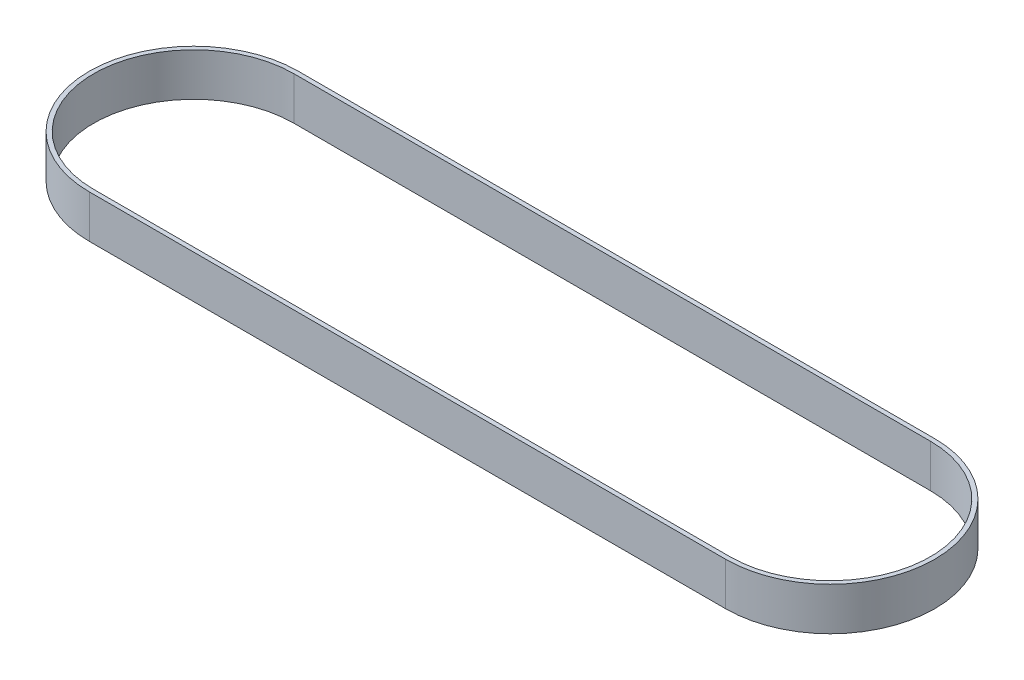
ISO-10303-21;
HEADER;
FILE_DESCRIPTION(('STEP AP214'),'2;1');
FILE_NAME('part.step','',(''),(''),'','','');
FILE_SCHEMA(('AUTOMOTIVE_DESIGN { 1 0 10303 214 1 1 1 1 }'));
ENDSEC;
DATA;
#1=APPLICATION_CONTEXT('core data for automotive mechanical design processes');
#2=APPLICATION_PROTOCOL_DEFINITION('international standard','automotive_design',2000,#1);
#3=PRODUCT_CONTEXT('',#1,'mechanical');
#4=PRODUCT('Part','Part','',(#3));
#5=PRODUCT_RELATED_PRODUCT_CATEGORY('part','',(#4));
#6=PRODUCT_DEFINITION_FORMATION('','',#4);
#7=PRODUCT_DEFINITION_CONTEXT('part definition',#1,'design');
#8=PRODUCT_DEFINITION('design','',#6,#7);
#9=PRODUCT_DEFINITION_SHAPE('','',#8);
#10=(LENGTH_UNIT() NAMED_UNIT(*) SI_UNIT(.MILLI.,.METRE.));
#11=(NAMED_UNIT(*) PLANE_ANGLE_UNIT() SI_UNIT($,.RADIAN.));
#12=(NAMED_UNIT(*) SI_UNIT($,.STERADIAN.) SOLID_ANGLE_UNIT());
#13=UNCERTAINTY_MEASURE_WITH_UNIT(LENGTH_MEASURE(1.E-05),#10,'distance_accuracy_value','');
#14=(GEOMETRIC_REPRESENTATION_CONTEXT(3) GLOBAL_UNCERTAINTY_ASSIGNED_CONTEXT((#13)) GLOBAL_UNIT_ASSIGNED_CONTEXT((#10,
#11,#12)) REPRESENTATION_CONTEXT('',''));
#15=CARTESIAN_POINT('',(0.,0.,0.));
#16=DIRECTION('',(0.,0.,1.));
#17=DIRECTION('',(1.,0.,0.));
#18=AXIS2_PLACEMENT_3D('',#15,#16,#17);
#19=CARTESIAN_POINT('',(0.,15.,-36.5379));
#20=DIRECTION('',(0.,0.,1.));
#21=DIRECTION('',(1.,0.,0.));
#22=AXIS2_PLACEMENT_3D('',#19,#20,#21);
#23=PLANE('',#22);
#24=DIRECTION('',(0.,-1.,0.));
#25=VECTOR('',#24,1.);
#26=CARTESIAN_POINT('',(0.,15.,-36.5379));
#27=LINE('',#26,#25);
#28=CARTESIAN_POINT('',(0.,15.,-36.5379000004));
#29=VERTEX_POINT('',#28);
#30=CARTESIAN_POINT('',(0.,0.,-36.5379000004));
#31=VERTEX_POINT('',#30);
#32=EDGE_CURVE('E66',#29,#31,#27,.T.);
#33=ORIENTED_EDGE('',*,*,#32,.F.);
#34=DIRECTION('',(1.,0.,0.));
#35=VECTOR('',#34,1.);
#36=CARTESIAN_POINT('',(0.,15.,-36.5379000008));
#37=LINE('',#36,#35);
#38=CARTESIAN_POINT('',(222.5548,15.,-36.5379000004));
#39=VERTEX_POINT('',#38);
#40=EDGE_CURVE('E68',#39,#29,#37,.F.);
#41=ORIENTED_EDGE('',*,*,#40,.F.);
#42=DIRECTION('',(0.,-1.,0.));
#43=VECTOR('',#42,1.);
#44=CARTESIAN_POINT('',(222.5548,15.,-36.5379));
#45=LINE('',#44,#43);
#46=CARTESIAN_POINT('',(222.5548,0.,-36.5379000004));
#47=VERTEX_POINT('',#46);
#48=EDGE_CURVE('E116',#47,#39,#45,.F.);
#49=ORIENTED_EDGE('',*,*,#48,.F.);
#50=DIRECTION('',(1.,0.,0.));
#51=VECTOR('',#50,1.);
#52=CARTESIAN_POINT('',(0.,0.,-36.5379000008));
#53=LINE('',#52,#51);
#54=EDGE_CURVE('E70',#47,#31,#53,.F.);
#55=ORIENTED_EDGE('',*,*,#54,.T.);
#56=EDGE_LOOP('',(#33,#41,#49,#55));
#57=FACE_BOUND('',#56,.T.);
#58=ADVANCED_FACE('F17',(#57),#23,.F.);
#59=CARTESIAN_POINT('',(0.,15.,-35.0139));
#60=DIRECTION('',(0.,0.,1.));
#61=DIRECTION('',(1.,0.,0.));
#62=AXIS2_PLACEMENT_3D('',#59,#60,#61);
#63=PLANE('',#62);
#64=DIRECTION('',(1.,0.,0.));
#65=VECTOR('',#64,1.);
#66=CARTESIAN_POINT('',(0.,15.,-35.0139000006));
#67=LINE('',#66,#65);
#68=CARTESIAN_POINT('',(0.,15.,-35.0139000003));
#69=VERTEX_POINT('',#68);
#70=CARTESIAN_POINT('',(222.5548,15.,-35.0139000003));
#71=VERTEX_POINT('',#70);
#72=EDGE_CURVE('E100',#69,#71,#67,.T.);
#73=ORIENTED_EDGE('',*,*,#72,.F.);
#74=DIRECTION('',(0.,-1.,0.));
#75=VECTOR('',#74,1.);
#76=CARTESIAN_POINT('',(0.,15.,-35.0139));
#77=LINE('',#76,#75);
#78=CARTESIAN_POINT('',(0.,0.,-35.0139000003));
#79=VERTEX_POINT('',#78);
#80=EDGE_CURVE('E75',#69,#79,#77,.T.);
#81=ORIENTED_EDGE('',*,*,#80,.T.);
#82=DIRECTION('',(1.,0.,0.));
#83=VECTOR('',#82,1.);
#84=CARTESIAN_POINT('',(0.,0.,-35.0139000006));
#85=LINE('',#84,#83);
#86=CARTESIAN_POINT('',(222.5548,0.,-35.0139000003));
#87=VERTEX_POINT('',#86);
#88=EDGE_CURVE('E121',#79,#87,#85,.T.);
#89=ORIENTED_EDGE('',*,*,#88,.T.);
#90=DIRECTION('',(0.,-1.,0.));
#91=VECTOR('',#90,1.);
#92=CARTESIAN_POINT('',(222.5548,15.,-35.0139));
#93=LINE('',#92,#91);
#94=EDGE_CURVE('E113',#87,#71,#93,.F.);
#95=ORIENTED_EDGE('',*,*,#94,.T.);
#96=EDGE_LOOP('',(#73,#81,#89,#95));
#97=FACE_BOUND('',#96,.T.);
#98=ADVANCED_FACE('F134',(#97),#63,.T.);
#99=CARTESIAN_POINT('',(222.5548,15.,0.));
#100=DIRECTION('',(0.,-1.,0.));
#101=DIRECTION('',(0.,0.,-1.));
#102=AXIS2_PLACEMENT_3D('',#99,#100,#101);
#103=CYLINDRICAL_SURFACE('',#102,35.0139);
#104=DIRECTION('',(0.,1.,0.));
#105=VECTOR('',#104,1.);
#106=CARTESIAN_POINT('',(222.5548,15.,35.0139));
#107=LINE('',#106,#105);
#108=CARTESIAN_POINT('',(222.5548,15.,35.0139000003));
#109=VERTEX_POINT('',#108);
#110=CARTESIAN_POINT('',(222.5548,0.,35.0139000003));
#111=VERTEX_POINT('',#110);
#112=EDGE_CURVE('E110',#109,#111,#107,.F.);
#113=ORIENTED_EDGE('',*,*,#112,.F.);
#114=CARTESIAN_POINT('',(222.5548,15.,0.));
#115=DIRECTION('',(0.,-1.,0.));
#116=DIRECTION('',(0.,0.,-1.));
#117=AXIS2_PLACEMENT_3D('',#114,#115,#116);
#118=CIRCLE('',#117,35.0139);
#119=EDGE_CURVE('E102',#71,#109,#118,.T.);
#120=ORIENTED_EDGE('',*,*,#119,.F.);
#121=ORIENTED_EDGE('',*,*,#94,.F.);
#122=CARTESIAN_POINT('',(222.5548,0.,0.));
#123=DIRECTION('',(0.,-1.,0.));
#124=DIRECTION('',(0.,0.,-1.));
#125=AXIS2_PLACEMENT_3D('',#122,#123,#124);
#126=CIRCLE('',#125,35.0139);
#127=EDGE_CURVE('E118',#87,#111,#126,.T.);
#128=ORIENTED_EDGE('',*,*,#127,.T.);
#129=EDGE_LOOP('',(#113,#120,#121,#128));
#130=FACE_BOUND('',#129,.T.);
#131=ADVANCED_FACE('F143',(#130),#103,.F.);
#132=CARTESIAN_POINT('',(0.,15.,35.0139));
#133=DIRECTION('',(0.,0.,-1.));
#134=DIRECTION('',(-1.,0.,0.));
#135=AXIS2_PLACEMENT_3D('',#132,#133,#134);
#136=PLANE('',#135);
#137=DIRECTION('',(1.,0.,0.));
#138=VECTOR('',#137,1.);
#139=CARTESIAN_POINT('',(0.,15.,35.0139000006));
#140=LINE('',#139,#138);
#141=CARTESIAN_POINT('',(0.,15.,35.0139000003));
#142=VERTEX_POINT('',#141);
#143=EDGE_CURVE('E83',#109,#142,#140,.F.);
#144=ORIENTED_EDGE('',*,*,#143,.F.);
#145=ORIENTED_EDGE('',*,*,#112,.T.);
#146=DIRECTION('',(1.,0.,0.));
#147=VECTOR('',#146,1.);
#148=CARTESIAN_POINT('',(0.,0.,35.0139000006));
#149=LINE('',#148,#147);
#150=CARTESIAN_POINT('',(0.,0.,35.0139000003));
#151=VERTEX_POINT('',#150);
#152=EDGE_CURVE('E96',#111,#151,#149,.F.);
#153=ORIENTED_EDGE('',*,*,#152,.T.);
#154=DIRECTION('',(0.,-1.,0.));
#155=VECTOR('',#154,1.);
#156=CARTESIAN_POINT('',(0.,15.,35.0139));
#157=LINE('',#156,#155);
#158=EDGE_CURVE('E107',#151,#142,#157,.F.);
#159=ORIENTED_EDGE('',*,*,#158,.T.);
#160=EDGE_LOOP('',(#144,#145,#153,#159));
#161=FACE_BOUND('',#160,.T.);
#162=ADVANCED_FACE('F145',(#161),#136,.T.);
#163=CARTESIAN_POINT('',(0.,15.,0.));
#164=DIRECTION('',(0.,-1.,0.));
#165=DIRECTION('',(0.,0.,-1.));
#166=AXIS2_PLACEMENT_3D('',#163,#164,#165);
#167=CYLINDRICAL_SURFACE('',#166,35.0139);
#168=ORIENTED_EDGE('',*,*,#80,.F.);
#169=CARTESIAN_POINT('',(0.,15.,0.));
#170=DIRECTION('',(0.,-1.,0.));
#171=DIRECTION('',(0.,0.,-1.));
#172=AXIS2_PLACEMENT_3D('',#169,#170,#171);
#173=CIRCLE('',#172,35.0139);
#174=EDGE_CURVE('E103',#142,#69,#173,.T.);
#175=ORIENTED_EDGE('',*,*,#174,.F.);
#176=ORIENTED_EDGE('',*,*,#158,.F.);
#177=CARTESIAN_POINT('',(0.,0.,0.));
#178=DIRECTION('',(0.,-1.,0.));
#179=DIRECTION('',(0.,0.,-1.));
#180=AXIS2_PLACEMENT_3D('',#177,#178,#179);
#181=CIRCLE('',#180,35.0139);
#182=EDGE_CURVE('E92',#151,#79,#181,.T.);
#183=ORIENTED_EDGE('',*,*,#182,.T.);
#184=EDGE_LOOP('',(#168,#175,#176,#183));
#185=FACE_BOUND('',#184,.T.);
#186=ADVANCED_FACE('F151',(#185),#167,.F.);
#187=CARTESIAN_POINT('',(0.,15.,0.));
#188=DIRECTION('',(0.,-1.,0.));
#189=DIRECTION('',(0.,0.,-1.));
#190=AXIS2_PLACEMENT_3D('',#187,#188,#189);
#191=CYLINDRICAL_SURFACE('',#190,36.5379);
#192=CARTESIAN_POINT('',(0.,15.,0.));
#193=DIRECTION('',(0.,-1.,0.));
#194=DIRECTION('',(0.,0.,-1.));
#195=AXIS2_PLACEMENT_3D('',#192,#193,#194);
#196=CIRCLE('',#195,36.5379);
#197=CARTESIAN_POINT('',(0.,15.,36.5379));
#198=VERTEX_POINT('',#197);
#199=EDGE_CURVE('E20',#29,#198,#196,.F.);
#200=ORIENTED_EDGE('',*,*,#199,.F.);
#201=ORIENTED_EDGE('',*,*,#32,.T.);
#202=CARTESIAN_POINT('',(0.,0.,0.));
#203=DIRECTION('',(0.,-1.,0.));
#204=DIRECTION('',(0.,0.,-1.));
#205=AXIS2_PLACEMENT_3D('',#202,#203,#204);
#206=CIRCLE('',#205,36.5379);
#207=CARTESIAN_POINT('',(0.,0.,36.5379));
#208=VERTEX_POINT('',#207);
#209=EDGE_CURVE('E89',#31,#208,#206,.F.);
#210=ORIENTED_EDGE('',*,*,#209,.T.);
#211=DIRECTION('',(0.,1.,0.));
#212=VECTOR('',#211,1.);
#213=CARTESIAN_POINT('',(0.,15.,36.5379));
#214=LINE('',#213,#212);
#215=EDGE_CURVE('E88',#208,#198,#214,.T.);
#216=ORIENTED_EDGE('',*,*,#215,.T.);
#217=EDGE_LOOP('',(#200,#201,#210,#216));
#218=FACE_BOUND('',#217,.T.);
#219=ADVANCED_FACE('F86',(#218),#191,.T.);
#220=CARTESIAN_POINT('',(0.,15.,0.));
#221=DIRECTION('',(0.,1.,0.));
#222=DIRECTION('',(0.,0.,1.));
#223=AXIS2_PLACEMENT_3D('',#220,#221,#222);
#224=PLANE('',#223);
#225=ORIENTED_EDGE('',*,*,#72,.T.);
#226=ORIENTED_EDGE('',*,*,#119,.T.);
#227=ORIENTED_EDGE('',*,*,#143,.T.);
#228=ORIENTED_EDGE('',*,*,#174,.T.);
#229=EDGE_LOOP('',(#225,#226,#227,#228));
#230=FACE_BOUND('',#229,.T.);
#231=CARTESIAN_POINT('',(222.5548,15.,0.));
#232=DIRECTION('',(0.,-1.,0.));
#233=DIRECTION('',(0.,0.,-1.));
#234=AXIS2_PLACEMENT_3D('',#231,#232,#233);
#235=CIRCLE('',#234,36.5379);
#236=CARTESIAN_POINT('',(222.5548,15.,36.5379));
#237=VERTEX_POINT('',#236);
#238=EDGE_CURVE('E82',#39,#237,#235,.T.);
#239=ORIENTED_EDGE('',*,*,#238,.F.);
#240=ORIENTED_EDGE('',*,*,#40,.T.);
#241=ORIENTED_EDGE('',*,*,#199,.T.);
#242=DIRECTION('',(-1.,0.,0.));
#243=VECTOR('',#242,1.);
#244=CARTESIAN_POINT('',(0.,15.,36.5379));
#245=LINE('',#244,#243);
#246=EDGE_CURVE('E91',#198,#237,#245,.F.);
#247=ORIENTED_EDGE('',*,*,#246,.T.);
#248=EDGE_LOOP('',(#239,#240,#241,#247));
#249=FACE_BOUND('',#248,.T.);
#250=ADVANCED_FACE('F79',(#230,#249),#224,.T.);
#251=CARTESIAN_POINT('',(222.5548,15.,0.));
#252=DIRECTION('',(0.,-1.,0.));
#253=DIRECTION('',(0.,0.,-1.));
#254=AXIS2_PLACEMENT_3D('',#251,#252,#253);
#255=CYLINDRICAL_SURFACE('',#254,36.5379);
#256=ORIENTED_EDGE('',*,*,#238,.T.);
#257=DIRECTION('',(0.,1.,0.));
#258=VECTOR('',#257,1.);
#259=CARTESIAN_POINT('',(222.5548,15.,36.5379));
#260=LINE('',#259,#258);
#261=CARTESIAN_POINT('',(222.5548,0.,36.5379));
#262=VERTEX_POINT('',#261);
#263=EDGE_CURVE('E26',#237,#262,#260,.F.);
#264=ORIENTED_EDGE('',*,*,#263,.T.);
#265=CARTESIAN_POINT('',(222.5548,0.,0.));
#266=DIRECTION('',(0.,-1.,0.));
#267=DIRECTION('',(0.,0.,-1.));
#268=AXIS2_PLACEMENT_3D('',#265,#266,#267);
#269=CIRCLE('',#268,36.5379);
#270=EDGE_CURVE('E34',#262,#47,#269,.F.);
#271=ORIENTED_EDGE('',*,*,#270,.T.);
#272=ORIENTED_EDGE('',*,*,#48,.T.);
#273=EDGE_LOOP('',(#256,#264,#271,#272));
#274=FACE_BOUND('',#273,.T.);
#275=ADVANCED_FACE('F162',(#274),#255,.T.);
#276=CARTESIAN_POINT('',(0.,0.,0.));
#277=DIRECTION('',(0.,1.,0.));
#278=DIRECTION('',(0.,0.,1.));
#279=AXIS2_PLACEMENT_3D('',#276,#277,#278);
#280=PLANE('',#279);
#281=ORIENTED_EDGE('',*,*,#152,.F.);
#282=ORIENTED_EDGE('',*,*,#127,.F.);
#283=ORIENTED_EDGE('',*,*,#88,.F.);
#284=ORIENTED_EDGE('',*,*,#182,.F.);
#285=EDGE_LOOP('',(#281,#282,#283,#284));
#286=FACE_BOUND('',#285,.T.);
#287=ORIENTED_EDGE('',*,*,#54,.F.);
#288=ORIENTED_EDGE('',*,*,#270,.F.);
#289=DIRECTION('',(-1.,0.,0.));
#290=VECTOR('',#289,1.);
#291=CARTESIAN_POINT('',(0.,0.,36.5379));
#292=LINE('',#291,#290);
#293=EDGE_CURVE('E11',#262,#208,#292,.T.);
#294=ORIENTED_EDGE('',*,*,#293,.T.);
#295=ORIENTED_EDGE('',*,*,#209,.F.);
#296=EDGE_LOOP('',(#287,#288,#294,#295));
#297=FACE_BOUND('',#296,.T.);
#298=ADVANCED_FACE('F154',(#286,#297),#280,.F.);
#299=CARTESIAN_POINT('',(0.,15.,36.5379));
#300=DIRECTION('',(0.,0.,-1.));
#301=DIRECTION('',(-1.,0.,0.));
#302=AXIS2_PLACEMENT_3D('',#299,#300,#301);
#303=PLANE('',#302);
#304=ORIENTED_EDGE('',*,*,#263,.F.);
#305=ORIENTED_EDGE('',*,*,#246,.F.);
#306=ORIENTED_EDGE('',*,*,#215,.F.);
#307=ORIENTED_EDGE('',*,*,#293,.F.);
#308=EDGE_LOOP('',(#304,#305,#306,#307));
#309=FACE_BOUND('',#308,.T.);
#310=ADVANCED_FACE('F163',(#309),#303,.F.);
#311=CLOSED_SHELL('',(#58,#98,#131,#162,#186,#219,#250,#275,#298,#310));
#312=MANIFOLD_SOLID_BREP('B1',#311);
#313=ADVANCED_BREP_SHAPE_REPRESENTATION('',(#18,#312),#14);
#314=SHAPE_DEFINITION_REPRESENTATION(#9,#313);
ENDSEC;
END-ISO-10303-21;
